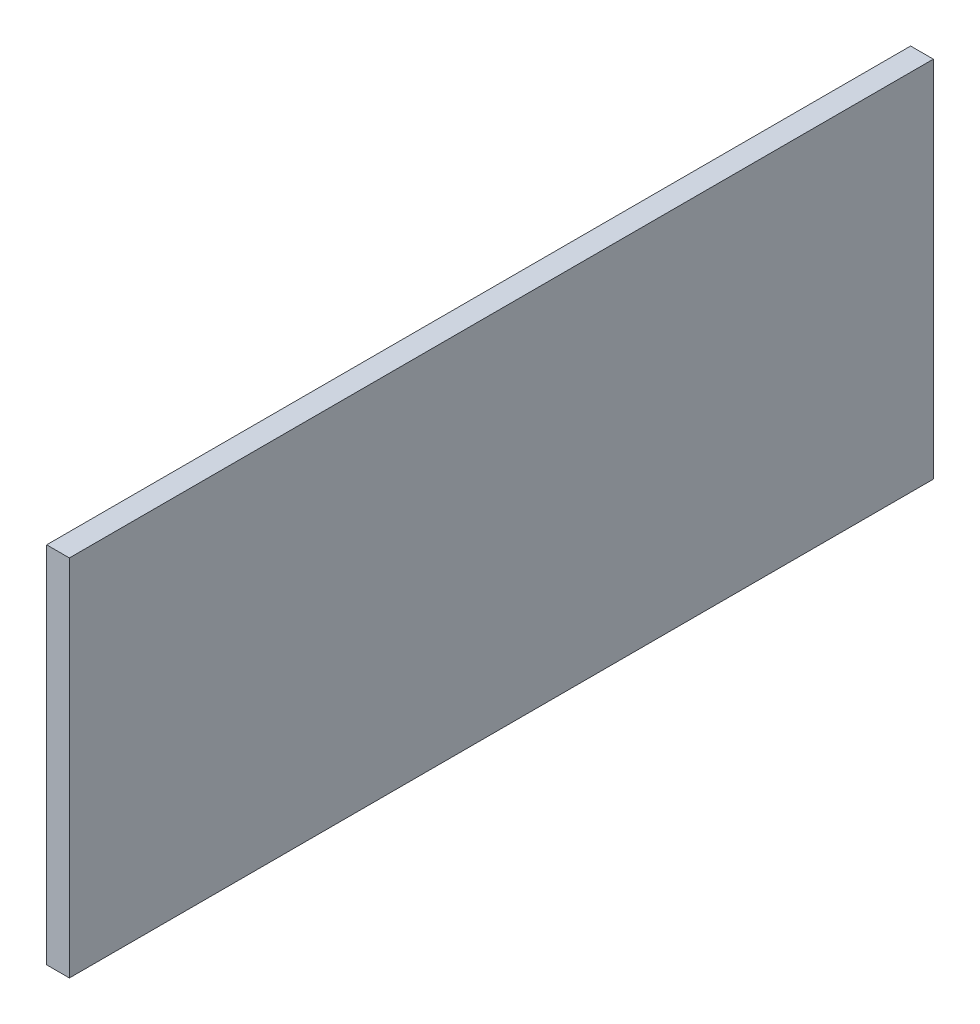
ISO-10303-21;
HEADER;
FILE_DESCRIPTION(('STEP AP214'),'2;1');
FILE_NAME('part.step','',(''),(''),'','','');
FILE_SCHEMA(('AUTOMOTIVE_DESIGN { 1 0 10303 214 1 1 1 1 }'));
ENDSEC;
DATA;
#1=APPLICATION_CONTEXT('core data for automotive mechanical design processes');
#2=APPLICATION_PROTOCOL_DEFINITION('international standard','automotive_design',2000,#1);
#3=PRODUCT_CONTEXT('',#1,'mechanical');
#4=PRODUCT('Part','Part','',(#3));
#5=PRODUCT_RELATED_PRODUCT_CATEGORY('part','',(#4));
#6=PRODUCT_DEFINITION_FORMATION('','',#4);
#7=PRODUCT_DEFINITION_CONTEXT('part definition',#1,'design');
#8=PRODUCT_DEFINITION('design','',#6,#7);
#9=PRODUCT_DEFINITION_SHAPE('','',#8);
#10=(LENGTH_UNIT() NAMED_UNIT(*) SI_UNIT(.MILLI.,.METRE.));
#11=(NAMED_UNIT(*) PLANE_ANGLE_UNIT() SI_UNIT($,.RADIAN.));
#12=(NAMED_UNIT(*) SI_UNIT($,.STERADIAN.) SOLID_ANGLE_UNIT());
#13=UNCERTAINTY_MEASURE_WITH_UNIT(LENGTH_MEASURE(1.E-05),#10,'distance_accuracy_value','');
#14=(GEOMETRIC_REPRESENTATION_CONTEXT(3) GLOBAL_UNCERTAINTY_ASSIGNED_CONTEXT((#13)) GLOBAL_UNIT_ASSIGNED_CONTEXT((#10,
#11,#12)) REPRESENTATION_CONTEXT('',''));
#15=CARTESIAN_POINT('',(0.,0.,0.));
#16=DIRECTION('',(0.,0.,1.));
#17=DIRECTION('',(1.,0.,0.));
#18=AXIS2_PLACEMENT_3D('',#15,#16,#17);
#19=CARTESIAN_POINT('',(101.6,50.8,60.325));
#20=DIRECTION('',(0.,0.,-1.));
#21=DIRECTION('',(-1.,0.,0.));
#22=AXIS2_PLACEMENT_3D('',#19,#20,#21);
#23=PLANE('',#22);
#24=DIRECTION('',(1.,0.,0.));
#25=VECTOR('',#24,1.);
#26=CARTESIAN_POINT('',(101.6,50.8,60.325));
#27=LINE('',#26,#25);
#28=CARTESIAN_POINT('',(98.425,50.8,60.325));
#29=VERTEX_POINT('',#28);
#30=CARTESIAN_POINT('',(101.6,50.8,60.325));
#31=VERTEX_POINT('',#30);
#32=EDGE_CURVE('E84',#29,#31,#27,.T.);
#33=ORIENTED_EDGE('',*,*,#32,.F.);
#34=DIRECTION('',(0.,1.,0.));
#35=VECTOR('',#34,1.);
#36=CARTESIAN_POINT('',(98.425,0.,60.325));
#37=LINE('',#36,#35);
#38=CARTESIAN_POINT('',(98.425,0.,60.325));
#39=VERTEX_POINT('',#38);
#40=EDGE_CURVE('E89',#39,#29,#37,.T.);
#41=ORIENTED_EDGE('',*,*,#40,.F.);
#42=DIRECTION('',(1.,0.,0.));
#43=VECTOR('',#42,1.);
#44=CARTESIAN_POINT('',(101.6,0.,60.325));
#45=LINE('',#44,#43);
#46=CARTESIAN_POINT('',(101.6,0.,60.325));
#47=VERTEX_POINT('',#46);
#48=EDGE_CURVE('E65',#39,#47,#45,.T.);
#49=ORIENTED_EDGE('',*,*,#48,.T.);
#50=DIRECTION('',(0.,-1.,0.));
#51=VECTOR('',#50,1.);
#52=CARTESIAN_POINT('',(101.6,50.8,60.325));
#53=LINE('',#52,#51);
#54=EDGE_CURVE('E11',#31,#47,#53,.T.);
#55=ORIENTED_EDGE('',*,*,#54,.F.);
#56=EDGE_LOOP('',(#33,#41,#49,#55));
#57=FACE_BOUND('',#56,.T.);
#58=ADVANCED_FACE('F37',(#57),#23,.F.);
#59=CARTESIAN_POINT('',(101.6,50.8,60.325));
#60=DIRECTION('',(-1.,0.,0.));
#61=DIRECTION('',(0.,0.,1.));
#62=AXIS2_PLACEMENT_3D('',#59,#60,#61);
#63=PLANE('',#62);
#64=ORIENTED_EDGE('',*,*,#54,.T.);
#65=DIRECTION('',(0.,0.,-1.));
#66=VECTOR('',#65,1.);
#67=CARTESIAN_POINT('',(101.6,0.,60.325));
#68=LINE('',#67,#66);
#69=CARTESIAN_POINT('',(101.6,0.,-60.325));
#70=VERTEX_POINT('',#69);
#71=EDGE_CURVE('E104',#47,#70,#68,.T.);
#72=ORIENTED_EDGE('',*,*,#71,.T.);
#73=DIRECTION('',(0.,-1.,0.));
#74=VECTOR('',#73,1.);
#75=CARTESIAN_POINT('',(101.6,50.8,-60.325));
#76=LINE('',#75,#74);
#77=CARTESIAN_POINT('',(101.6,50.8,-60.325));
#78=VERTEX_POINT('',#77);
#79=EDGE_CURVE('E46',#78,#70,#76,.T.);
#80=ORIENTED_EDGE('',*,*,#79,.F.);
#81=DIRECTION('',(0.,0.,-1.));
#82=VECTOR('',#81,1.);
#83=CARTESIAN_POINT('',(101.6,50.8,60.325));
#84=LINE('',#83,#82);
#85=EDGE_CURVE('E54',#31,#78,#84,.T.);
#86=ORIENTED_EDGE('',*,*,#85,.F.);
#87=EDGE_LOOP('',(#64,#72,#80,#86));
#88=FACE_BOUND('',#87,.T.);
#89=ADVANCED_FACE('F119',(#88),#63,.F.);
#90=CARTESIAN_POINT('',(101.6,50.8,-60.325));
#91=DIRECTION('',(0.,0.,1.));
#92=DIRECTION('',(1.,0.,0.));
#93=AXIS2_PLACEMENT_3D('',#90,#91,#92);
#94=PLANE('',#93);
#95=DIRECTION('',(-1.,0.,0.));
#96=VECTOR('',#95,1.);
#97=CARTESIAN_POINT('',(101.6,0.,-60.325));
#98=LINE('',#97,#96);
#99=CARTESIAN_POINT('',(98.425,0.,-60.325));
#100=VERTEX_POINT('',#99);
#101=EDGE_CURVE('E96',#70,#100,#98,.T.);
#102=ORIENTED_EDGE('',*,*,#101,.T.);
#103=DIRECTION('',(0.,1.,0.));
#104=VECTOR('',#103,1.);
#105=CARTESIAN_POINT('',(98.425,0.,-60.325));
#106=LINE('',#105,#104);
#107=CARTESIAN_POINT('',(98.425,50.8,-60.325));
#108=VERTEX_POINT('',#107);
#109=EDGE_CURVE('E93',#100,#108,#106,.T.);
#110=ORIENTED_EDGE('',*,*,#109,.T.);
#111=DIRECTION('',(-1.,0.,0.));
#112=VECTOR('',#111,1.);
#113=CARTESIAN_POINT('',(101.6,50.8,-60.325));
#114=LINE('',#113,#112);
#115=EDGE_CURVE('E86',#78,#108,#114,.T.);
#116=ORIENTED_EDGE('',*,*,#115,.F.);
#117=ORIENTED_EDGE('',*,*,#79,.T.);
#118=EDGE_LOOP('',(#102,#110,#116,#117));
#119=FACE_BOUND('',#118,.T.);
#120=ADVANCED_FACE('F115',(#119),#94,.F.);
#121=CARTESIAN_POINT('',(0.,50.8,0.));
#122=DIRECTION('',(0.,1.,0.));
#123=DIRECTION('',(0.,0.,1.));
#124=AXIS2_PLACEMENT_3D('',#121,#122,#123);
#125=PLANE('',#124);
#126=DIRECTION('',(0.,0.,-1.));
#127=VECTOR('',#126,1.);
#128=CARTESIAN_POINT('',(98.425,50.8,57.15));
#129=LINE('',#128,#127);
#130=EDGE_CURVE('E81',#29,#108,#129,.T.);
#131=ORIENTED_EDGE('',*,*,#130,.F.);
#132=ORIENTED_EDGE('',*,*,#32,.T.);
#133=ORIENTED_EDGE('',*,*,#85,.T.);
#134=ORIENTED_EDGE('',*,*,#115,.T.);
#135=EDGE_LOOP('',(#131,#132,#133,#134));
#136=FACE_BOUND('',#135,.T.);
#137=ADVANCED_FACE('F82',(#136),#125,.T.);
#138=CARTESIAN_POINT('',(0.,0.,0.));
#139=DIRECTION('',(0.,1.,0.));
#140=DIRECTION('',(0.,0.,1.));
#141=AXIS2_PLACEMENT_3D('',#138,#139,#140);
#142=PLANE('',#141);
#143=ORIENTED_EDGE('',*,*,#48,.F.);
#144=DIRECTION('',(0.,0.,-1.));
#145=VECTOR('',#144,1.);
#146=CARTESIAN_POINT('',(98.425,0.,57.15));
#147=LINE('',#146,#145);
#148=EDGE_CURVE('E74',#39,#100,#147,.T.);
#149=ORIENTED_EDGE('',*,*,#148,.T.);
#150=ORIENTED_EDGE('',*,*,#101,.F.);
#151=ORIENTED_EDGE('',*,*,#71,.F.);
#152=EDGE_LOOP('',(#143,#149,#150,#151));
#153=FACE_BOUND('',#152,.T.);
#154=ADVANCED_FACE('F121',(#153),#142,.F.);
#155=CARTESIAN_POINT('',(98.425,0.,57.15));
#156=DIRECTION('',(1.,0.,0.));
#157=DIRECTION('',(0.,0.,-1.));
#158=AXIS2_PLACEMENT_3D('',#155,#156,#157);
#159=PLANE('',#158);
#160=ORIENTED_EDGE('',*,*,#130,.T.);
#161=ORIENTED_EDGE('',*,*,#109,.F.);
#162=ORIENTED_EDGE('',*,*,#148,.F.);
#163=ORIENTED_EDGE('',*,*,#40,.T.);
#164=EDGE_LOOP('',(#160,#161,#162,#163));
#165=FACE_BOUND('',#164,.T.);
#166=ADVANCED_FACE('F91',(#165),#159,.F.);
#167=CLOSED_SHELL('',(#58,#89,#120,#137,#154,#166));
#168=MANIFOLD_SOLID_BREP('B2',#167);
#169=ADVANCED_BREP_SHAPE_REPRESENTATION('',(#18,#168),#14);
#170=SHAPE_DEFINITION_REPRESENTATION(#9,#169);
ENDSEC;
END-ISO-10303-21;
